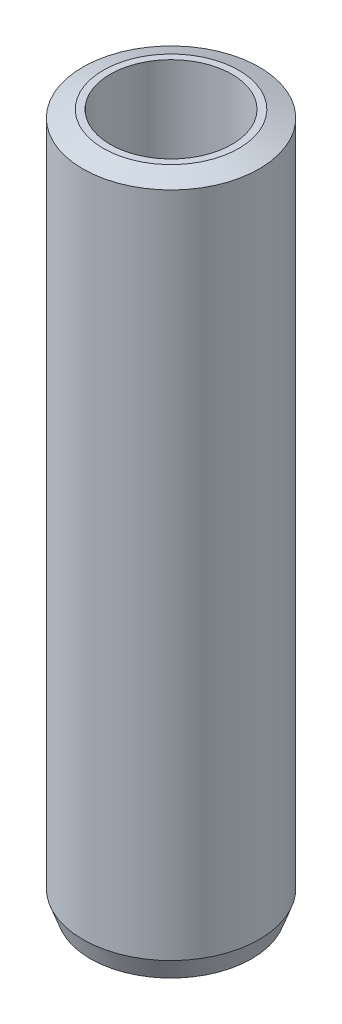
ISO-10303-21;
HEADER;
FILE_DESCRIPTION(('STEP AP214'),'2;1');
FILE_NAME('part.step','',(''),(''),'','','');
FILE_SCHEMA(('AUTOMOTIVE_DESIGN { 1 0 10303 214 1 1 1 1 }'));
ENDSEC;
DATA;
#1=APPLICATION_CONTEXT('core data for automotive mechanical design processes');
#2=APPLICATION_PROTOCOL_DEFINITION('international standard','automotive_design',2000,#1);
#3=PRODUCT_CONTEXT('',#1,'mechanical');
#4=PRODUCT('Part','Part','',(#3));
#5=PRODUCT_RELATED_PRODUCT_CATEGORY('part','',(#4));
#6=PRODUCT_DEFINITION_FORMATION('','',#4);
#7=PRODUCT_DEFINITION_CONTEXT('part definition',#1,'design');
#8=PRODUCT_DEFINITION('design','',#6,#7);
#9=PRODUCT_DEFINITION_SHAPE('','',#8);
#10=(LENGTH_UNIT() NAMED_UNIT(*) SI_UNIT(.MILLI.,.METRE.));
#11=(NAMED_UNIT(*) PLANE_ANGLE_UNIT() SI_UNIT($,.RADIAN.));
#12=(NAMED_UNIT(*) SI_UNIT($,.STERADIAN.) SOLID_ANGLE_UNIT());
#13=UNCERTAINTY_MEASURE_WITH_UNIT(LENGTH_MEASURE(1.E-05),#10,'distance_accuracy_value','');
#14=(GEOMETRIC_REPRESENTATION_CONTEXT(3) GLOBAL_UNCERTAINTY_ASSIGNED_CONTEXT((#13)) GLOBAL_UNIT_ASSIGNED_CONTEXT((#10,
#11,#12)) REPRESENTATION_CONTEXT('',''));
#15=CARTESIAN_POINT('',(0.,0.,0.));
#16=DIRECTION('',(0.,0.,1.));
#17=DIRECTION('',(1.,0.,0.));
#18=AXIS2_PLACEMENT_3D('',#15,#16,#17);
#19=CARTESIAN_POINT('',(0.,216.73695716357,0.));
#20=DIRECTION('',(0.,-1.,0.));
#21=DIRECTION('',(0.,0.,-1.));
#22=AXIS2_PLACEMENT_3D('',#19,#20,#21);
#23=CYLINDRICAL_SURFACE('',#22,27.5);
#24=CARTESIAN_POINT('',(0.,214.400970122933,0.));
#25=DIRECTION('',(0.,1.,0.));
#26=DIRECTION('',(0.,0.,1.));
#27=AXIS2_PLACEMENT_3D('',#24,#25,#26);
#28=CIRCLE('',#27,27.5);
#29=CARTESIAN_POINT('',(0.,214.400970122933,27.5));
#30=VERTEX_POINT('',#29);
#31=EDGE_CURVE('E50',#30,#30,#28,.F.);
#32=ORIENTED_EDGE('',*,*,#31,.T.);
#33=EDGE_LOOP('',(#32));
#34=FACE_BOUND('',#33,.T.);
#35=CARTESIAN_POINT('',(0.,6.37971192577091,0.));
#36=DIRECTION('',(0.,1.,0.));
#37=DIRECTION('',(0.,0.,1.));
#38=AXIS2_PLACEMENT_3D('',#35,#36,#37);
#39=CIRCLE('',#38,27.5);
#40=CARTESIAN_POINT('',(0.,6.37971192577091,27.5));
#41=VERTEX_POINT('',#40);
#42=EDGE_CURVE('E51',#41,#41,#39,.T.);
#43=ORIENTED_EDGE('',*,*,#42,.T.);
#44=EDGE_LOOP('',(#43));
#45=FACE_BOUND('',#44,.T.);
#46=ADVANCED_FACE('F39',(#34,#45),#23,.T.);
#47=CARTESIAN_POINT('',(0.,216.73695716357,0.));
#48=DIRECTION('',(0.,1.,0.));
#49=DIRECTION('',(0.,0.,1.));
#50=AXIS2_PLACEMENT_3D('',#47,#48,#49);
#51=PLANE('',#50);
#52=CARTESIAN_POINT('',(0.,216.73695716357,0.));
#53=DIRECTION('',(0.,1.,0.));
#54=DIRECTION('',(0.,0.,1.));
#55=AXIS2_PLACEMENT_3D('',#52,#53,#54);
#56=CIRCLE('',#55,21.1202880742292);
#57=CARTESIAN_POINT('',(0.,216.73695716357,21.1202880742292));
#58=VERTEX_POINT('',#57);
#59=EDGE_CURVE('E54',#58,#58,#56,.T.);
#60=ORIENTED_EDGE('',*,*,#59,.T.);
#61=EDGE_LOOP('',(#60));
#62=FACE_BOUND('',#61,.T.);
#63=CARTESIAN_POINT('',(0.,216.73695716357,0.));
#64=DIRECTION('',(0.,1.,0.));
#65=DIRECTION('',(0.,0.,1.));
#66=AXIS2_PLACEMENT_3D('',#63,#64,#65);
#67=CIRCLE('',#66,18.9655125970213);
#68=CARTESIAN_POINT('',(0.,216.73695716357,18.9655125970213));
#69=VERTEX_POINT('',#68);
#70=EDGE_CURVE('E58',#69,#69,#67,.T.);
#71=ORIENTED_EDGE('',*,*,#70,.F.);
#72=EDGE_LOOP('',(#71));
#73=FACE_BOUND('',#72,.T.);
#74=ADVANCED_FACE('F69',(#62,#73),#51,.T.);
#75=CARTESIAN_POINT('',(0.,0.,0.));
#76=DIRECTION('',(0.,1.,0.));
#77=DIRECTION('',(0.,0.,1.));
#78=AXIS2_PLACEMENT_3D('',#75,#76,#77);
#79=PLANE('',#78);
#80=CARTESIAN_POINT('',(0.,0.,0.));
#81=DIRECTION('',(0.,1.,0.));
#82=DIRECTION('',(0.,0.,1.));
#83=AXIS2_PLACEMENT_3D('',#80,#81,#82);
#84=CIRCLE('',#83,25.1640129593625);
#85=CARTESIAN_POINT('',(0.,0.,25.1640129593625));
#86=VERTEX_POINT('',#85);
#87=EDGE_CURVE('E10',#86,#86,#84,.F.);
#88=ORIENTED_EDGE('',*,*,#87,.T.);
#89=EDGE_LOOP('',(#88));
#90=FACE_BOUND('',#89,.T.);
#91=CARTESIAN_POINT('',(0.,0.,0.));
#92=DIRECTION('',(0.,1.,0.));
#93=DIRECTION('',(0.,0.,1.));
#94=AXIS2_PLACEMENT_3D('',#91,#92,#93);
#95=CIRCLE('',#94,18.9655125970213);
#96=CARTESIAN_POINT('',(0.,0.,18.9655125970213));
#97=VERTEX_POINT('',#96);
#98=EDGE_CURVE('E63',#97,#97,#95,.T.);
#99=ORIENTED_EDGE('',*,*,#98,.T.);
#100=EDGE_LOOP('',(#99));
#101=FACE_BOUND('',#100,.T.);
#102=ADVANCED_FACE('F75',(#90,#101),#79,.F.);
#103=CARTESIAN_POINT('',(0.,216.73695716357,0.));
#104=DIRECTION('',(0.,-1.,0.));
#105=DIRECTION('',(0.,0.,-1.));
#106=AXIS2_PLACEMENT_3D('',#103,#104,#105);
#107=CYLINDRICAL_SURFACE('',#106,18.9655125970213);
#108=ORIENTED_EDGE('',*,*,#70,.T.);
#109=EDGE_LOOP('',(#108));
#110=FACE_BOUND('',#109,.T.);
#111=ORIENTED_EDGE('',*,*,#98,.F.);
#112=EDGE_LOOP('',(#111));
#113=FACE_BOUND('',#112,.T.);
#114=ADVANCED_FACE('F70',(#110,#113),#107,.F.);
#115=CARTESIAN_POINT('',(0.,216.73695716357,0.));
#116=DIRECTION('',(0.,-1.,0.));
#117=DIRECTION('',(0.,0.,-1.));
#118=AXIS2_PLACEMENT_3D('',#115,#116,#117);
#119=CONICAL_SURFACE('',#118,21.1202880742292,1.21979937103809);
#120=ORIENTED_EDGE('',*,*,#31,.F.);
#121=EDGE_LOOP('',(#120));
#122=FACE_BOUND('',#121,.T.);
#123=ORIENTED_EDGE('',*,*,#59,.F.);
#124=EDGE_LOOP('',(#123));
#125=FACE_BOUND('',#124,.T.);
#126=ADVANCED_FACE('F81',(#122,#125),#119,.T.);
#127=CARTESIAN_POINT('',(0.,6.37971192577091,0.));
#128=DIRECTION('',(0.,1.,0.));
#129=DIRECTION('',(0.,0.,1.));
#130=AXIS2_PLACEMENT_3D('',#127,#128,#129);
#131=CONICAL_SURFACE('',#130,27.5,0.350996955756803);
#132=CARTESIAN_POINT('',(0.,0.,25.1640129593625));
#133=CARTESIAN_POINT('',(0.,0.0664553325601131,25.1883461577025));
#134=CARTESIAN_POINT('',(0.,0.132910665120227,25.2126793560425));
#135=CARTESIAN_POINT('',(0.,0.265821330240454,25.2613457527224));
#136=CARTESIAN_POINT('',(0.,0.332276662800568,25.2856789510624));
#137=CARTESIAN_POINT('',(0.,0.465187327920795,25.3343453477423));
#138=CARTESIAN_POINT('',(0.,0.531642660480908,25.3586785460823));
#139=CARTESIAN_POINT('',(0.,0.664553325601136,25.4073449427622));
#140=CARTESIAN_POINT('',(0.,0.73100865816125,25.4316781411022));
#141=CARTESIAN_POINT('',(0.,0.863919323281477,25.4803445377822));
#142=CARTESIAN_POINT('',(0.,0.930374655841591,25.5046777361221));
#143=CARTESIAN_POINT('',(0.,1.06328532096182,25.5533441328021));
#144=CARTESIAN_POINT('',(0.,1.12974065352193,25.5776773311421));
#145=CARTESIAN_POINT('',(0.,1.26265131864216,25.626343727822));
#146=CARTESIAN_POINT('',(0.,1.32910665120227,25.650676926162));
#147=CARTESIAN_POINT('',(0.,1.4620173163225,25.6993433228419));
#148=CARTESIAN_POINT('',(0.,1.52847264888261,25.7236765211819));
#149=CARTESIAN_POINT('',(0.,1.66138331400284,25.7723429178619));
#150=CARTESIAN_POINT('',(0.,1.72783864656296,25.7966761162018));
#151=CARTESIAN_POINT('',(0.,1.86074931168318,25.8453425128818));
#152=CARTESIAN_POINT('',(0.,1.9272046442433,25.8696757112217));
#153=CARTESIAN_POINT('',(0.,2.06011530936352,25.9183421079017));
#154=CARTESIAN_POINT('',(0.,2.12657064192364,25.9426753062417));
#155=CARTESIAN_POINT('',(0.,2.25948130704387,25.9913417029216));
#156=CARTESIAN_POINT('',(0.,2.32593663960398,26.0156749012616));
#157=CARTESIAN_POINT('',(0.,2.45884730472421,26.0643412979415));
#158=CARTESIAN_POINT('',(0.,2.52530263728432,26.0886744962815));
#159=CARTESIAN_POINT('',(0.,2.65821330240455,26.1373408929615));
#160=CARTESIAN_POINT('',(0.,2.72466863496466,26.1616740913014));
#161=CARTESIAN_POINT('',(0.,2.85757930008489,26.2103404879814));
#162=CARTESIAN_POINT('',(0.,2.924034632645,26.2346736863214));
#163=CARTESIAN_POINT('',(0.,3.05694529776523,26.2833400830013));
#164=CARTESIAN_POINT('',(0.,3.12340063032534,26.3076732813413));
#165=CARTESIAN_POINT('',(0.,3.25631129544557,26.3563396780212));
#166=CARTESIAN_POINT('',(0.,3.32276662800568,26.3806728763612));
#167=CARTESIAN_POINT('',(0.,3.45567729312591,26.4293392730412));
#168=CARTESIAN_POINT('',(0.,3.52213262568603,26.4536724713811));
#169=CARTESIAN_POINT('',(0.,3.65504329080625,26.5023388680611));
#170=CARTESIAN_POINT('',(0.,3.72149862336637,26.526672066401));
#171=CARTESIAN_POINT('',(0.,3.85440928848659,26.575338463081));
#172=CARTESIAN_POINT('',(0.,3.92086462104671,26.599671661421));
#173=CARTESIAN_POINT('',(0.,4.05377528616694,26.6483380581009));
#174=CARTESIAN_POINT('',(0.,4.12023061872705,26.6726712564409));
#175=CARTESIAN_POINT('',(0.,4.25314128384728,26.7213376531208));
#176=CARTESIAN_POINT('',(0.,4.31959661640739,26.7456708514608));
#177=CARTESIAN_POINT('',(0.,4.45250728152762,26.7943372481408));
#178=CARTESIAN_POINT('',(0.,4.51896261408773,26.8186704464807));
#179=CARTESIAN_POINT('',(0.,4.65187327920796,26.8673368431607));
#180=CARTESIAN_POINT('',(0.,4.71832861176807,26.8916700415007));
#181=CARTESIAN_POINT('',(0.,4.8512392768883,26.9403364381806));
#182=CARTESIAN_POINT('',(0.,4.91769460944841,26.9646696365206));
#183=CARTESIAN_POINT('',(0.,5.05060527456864,27.0133360332005));
#184=CARTESIAN_POINT('',(0.,5.11706060712875,27.0376692315405));
#185=CARTESIAN_POINT('',(0.,5.24997127224898,27.0863356282204));
#186=CARTESIAN_POINT('',(0.,5.3164266048091,27.1106688265604));
#187=CARTESIAN_POINT('',(0.,5.44933726992932,27.1593352232404));
#188=CARTESIAN_POINT('',(0.,5.51579260248944,27.1836684215803));
#189=CARTESIAN_POINT('',(0.,5.64870326760966,27.2323348182603));
#190=CARTESIAN_POINT('',(0.,5.71515860016978,27.2566680166003));
#191=CARTESIAN_POINT('',(0.,5.84806926529,27.3053344132802));
#192=CARTESIAN_POINT('',(0.,5.91452459785012,27.3296676116202));
#193=CARTESIAN_POINT('',(0.,6.04743526297035,27.3783340083001));
#194=CARTESIAN_POINT('',(0.,6.11389059553046,27.4026672066401));
#195=CARTESIAN_POINT('',(0.,6.24680126065069,27.4513336033201));
#196=CARTESIAN_POINT('',(0.,6.3132565932108,27.47566680166));
#197=CARTESIAN_POINT('',(0.,6.37971192577091,27.5));
#198=B_SPLINE_CURVE_WITH_KNOTS('',3,(#132,#133,#134,#135,#136,#137,#138,#139,#140,#141,#142,
#143,#144,#145,#146,#147,#148,#149,#150,#151,#152,#153,#154,#155,#156,#157,#158,#159,#160,#161,
#162,#163,#164,#165,#166,#167,#168,#169,#170,#171,#172,#173,#174,#175,#176,#177,#178,#179,#180,
#181,#182,#183,#184,#185,#186,#187,#188,#189,#190,#191,#192,#193,#194,#195,#196,#197),
.UNSPECIFIED.,.F.,.F.,(4,2,2,2,2,2,2,2,2,2,2,2,2,2,2,2,2,2,2,2,2,2,2,2,2,2,2,2,2,2,2,2,4),(0.,
0.212310484677865,0.424620969355731,0.636931454033598,0.849241938711463,1.06155242338933,
1.2738629080672,1.48617339274506,1.69848387742293,1.91079436210079,2.12310484677866,
2.33541533145652,2.54772581613439,2.76003630081226,2.97234678549012,3.18465727016799,
3.39696775484585,3.60927823952372,3.82158872420159,4.03389920887945,4.24620969355732,
4.45852017823518,4.67083066291305,4.88314114759092,5.09545163226878,5.30776211694665,
5.52007260162452,5.73238308630238,5.94469357098025,6.15700405565811,6.36931454033598,
6.58162502501385,6.79393550969171),.UNSPECIFIED.);
#199=EDGE_CURVE('BSEAM45',#86,#41,#198,.T.);
#200=ORIENTED_EDGE('',*,*,#87,.F.);
#201=ORIENTED_EDGE('',*,*,#42,.F.);
#202=ORIENTED_EDGE('',*,*,#199,.T.);
#203=ORIENTED_EDGE('',*,*,#199,.F.);
#204=EDGE_LOOP('',(#200,#202,#201,#203));
#205=FACE_BOUND('',#204,.T.);
#206=ADVANCED_FACE('F45',(#205),#131,.T.);
#207=CLOSED_SHELL('',(#46,#74,#102,#114,#126,#206));
#208=MANIFOLD_SOLID_BREP('B2',#207);
#209=ADVANCED_BREP_SHAPE_REPRESENTATION('',(#18,#208),#14);
#210=SHAPE_DEFINITION_REPRESENTATION(#9,#209);
ENDSEC;
END-ISO-10303-21;
